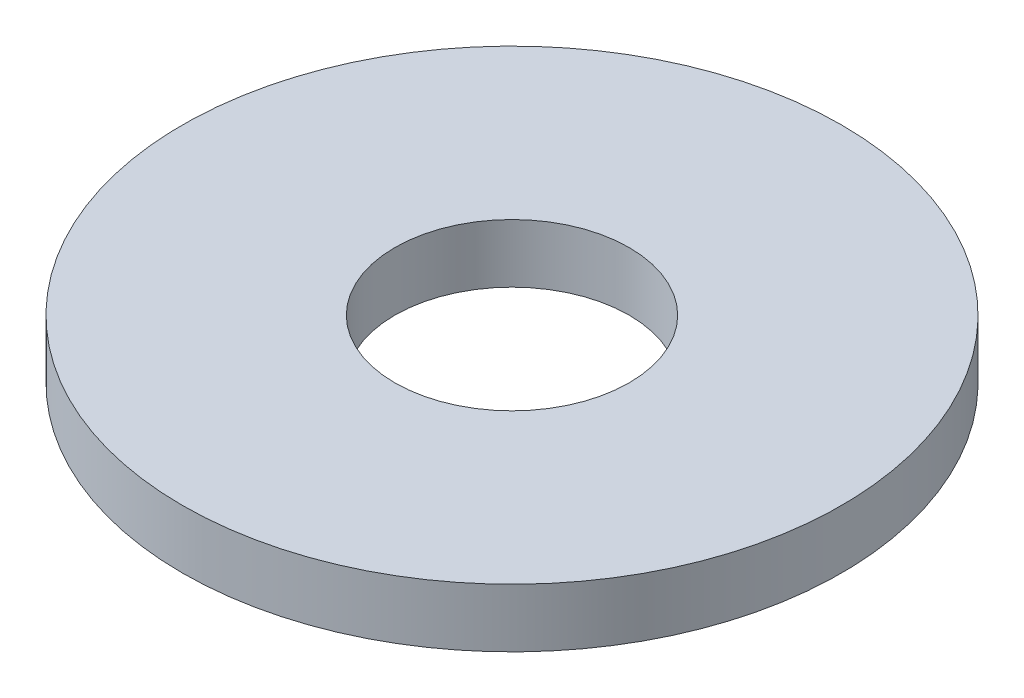
ISO-10303-21;
HEADER;
FILE_DESCRIPTION(('STEP AP214'),'2;1');
FILE_NAME('part.step','',(''),(''),'','','');
FILE_SCHEMA(('AUTOMOTIVE_DESIGN { 1 0 10303 214 1 1 1 1 }'));
ENDSEC;
DATA;
#1=APPLICATION_CONTEXT('core data for automotive mechanical design processes');
#2=APPLICATION_PROTOCOL_DEFINITION('international standard','automotive_design',2000,#1);
#3=PRODUCT_CONTEXT('',#1,'mechanical');
#4=PRODUCT('Part','Part','',(#3));
#5=PRODUCT_RELATED_PRODUCT_CATEGORY('part','',(#4));
#6=PRODUCT_DEFINITION_FORMATION('','',#4);
#7=PRODUCT_DEFINITION_CONTEXT('part definition',#1,'design');
#8=PRODUCT_DEFINITION('design','',#6,#7);
#9=PRODUCT_DEFINITION_SHAPE('','',#8);
#10=(LENGTH_UNIT() NAMED_UNIT(*) SI_UNIT(.MILLI.,.METRE.));
#11=(NAMED_UNIT(*) PLANE_ANGLE_UNIT() SI_UNIT($,.RADIAN.));
#12=(NAMED_UNIT(*) SI_UNIT($,.STERADIAN.) SOLID_ANGLE_UNIT());
#13=UNCERTAINTY_MEASURE_WITH_UNIT(LENGTH_MEASURE(1.E-05),#10,'distance_accuracy_value','');
#14=(GEOMETRIC_REPRESENTATION_CONTEXT(3) GLOBAL_UNCERTAINTY_ASSIGNED_CONTEXT((#13)) GLOBAL_UNIT_ASSIGNED_CONTEXT((#10,
#11,#12)) REPRESENTATION_CONTEXT('',''));
#15=CARTESIAN_POINT('',(0.,0.,0.));
#16=DIRECTION('',(0.,0.,1.));
#17=DIRECTION('',(1.,0.,0.));
#18=AXIS2_PLACEMENT_3D('',#15,#16,#17);
#19=CARTESIAN_POINT('',(0.,0.8,0.));
#20=DIRECTION('',(0.,1.,0.));
#21=DIRECTION('',(0.,0.,1.));
#22=AXIS2_PLACEMENT_3D('',#19,#20,#21);
#23=PLANE('',#22);
#24=CARTESIAN_POINT('',(0.,0.8,0.));
#25=DIRECTION('',(0.,1.,0.));
#26=DIRECTION('',(0.,0.,1.));
#27=AXIS2_PLACEMENT_3D('',#24,#25,#26);
#28=CIRCLE('',#27,4.5);
#29=CARTESIAN_POINT('',(0.,0.8,4.5));
#30=VERTEX_POINT('',#29);
#31=EDGE_CURVE('E10',#30,#30,#28,.T.);
#32=ORIENTED_EDGE('',*,*,#31,.T.);
#33=EDGE_LOOP('',(#32));
#34=FACE_BOUND('',#33,.T.);
#35=CARTESIAN_POINT('',(0.,0.8,0.));
#36=DIRECTION('',(0.,1.,0.));
#37=DIRECTION('',(0.,0.,1.));
#38=AXIS2_PLACEMENT_3D('',#35,#36,#37);
#39=CIRCLE('',#38,1.6);
#40=CARTESIAN_POINT('',(0.,0.8,1.6));
#41=VERTEX_POINT('',#40);
#42=EDGE_CURVE('E26',#41,#41,#39,.T.);
#43=ORIENTED_EDGE('',*,*,#42,.F.);
#44=EDGE_LOOP('',(#43));
#45=FACE_BOUND('',#44,.T.);
#46=ADVANCED_FACE('F14',(#34,#45),#23,.T.);
#47=CARTESIAN_POINT('',(0.,0.,0.));
#48=DIRECTION('',(0.,1.,0.));
#49=DIRECTION('',(0.,0.,1.));
#50=AXIS2_PLACEMENT_3D('',#47,#48,#49);
#51=PLANE('',#50);
#52=CARTESIAN_POINT('',(0.,0.,0.));
#53=DIRECTION('',(0.,1.,0.));
#54=DIRECTION('',(0.,0.,1.));
#55=AXIS2_PLACEMENT_3D('',#52,#53,#54);
#56=CIRCLE('',#55,4.5);
#57=CARTESIAN_POINT('',(0.,0.,4.5));
#58=VERTEX_POINT('',#57);
#59=EDGE_CURVE('E18',#58,#58,#56,.T.);
#60=ORIENTED_EDGE('',*,*,#59,.F.);
#61=EDGE_LOOP('',(#60));
#62=FACE_BOUND('',#61,.T.);
#63=CARTESIAN_POINT('',(0.,0.,0.));
#64=DIRECTION('',(0.,1.,0.));
#65=DIRECTION('',(0.,0.,1.));
#66=AXIS2_PLACEMENT_3D('',#63,#64,#65);
#67=CIRCLE('',#66,1.6);
#68=CARTESIAN_POINT('',(0.,0.,1.6));
#69=VERTEX_POINT('',#68);
#70=EDGE_CURVE('E28',#69,#69,#67,.T.);
#71=ORIENTED_EDGE('',*,*,#70,.T.);
#72=EDGE_LOOP('',(#71));
#73=FACE_BOUND('',#72,.T.);
#74=ADVANCED_FACE('F38',(#62,#73),#51,.F.);
#75=CARTESIAN_POINT('',(0.,0.8,0.));
#76=DIRECTION('',(0.,-1.,0.));
#77=DIRECTION('',(0.,0.,-1.));
#78=AXIS2_PLACEMENT_3D('',#75,#76,#77);
#79=CYLINDRICAL_SURFACE('',#78,4.5);
#80=ORIENTED_EDGE('',*,*,#31,.F.);
#81=EDGE_LOOP('',(#80));
#82=FACE_BOUND('',#81,.T.);
#83=ORIENTED_EDGE('',*,*,#59,.T.);
#84=EDGE_LOOP('',(#83));
#85=FACE_BOUND('',#84,.T.);
#86=ADVANCED_FACE('F16',(#82,#85),#79,.T.);
#87=CARTESIAN_POINT('',(0.,0.8,0.));
#88=DIRECTION('',(0.,-1.,0.));
#89=DIRECTION('',(0.,0.,-1.));
#90=AXIS2_PLACEMENT_3D('',#87,#88,#89);
#91=CYLINDRICAL_SURFACE('',#90,1.6);
#92=ORIENTED_EDGE('',*,*,#42,.T.);
#93=EDGE_LOOP('',(#92));
#94=FACE_BOUND('',#93,.T.);
#95=ORIENTED_EDGE('',*,*,#70,.F.);
#96=EDGE_LOOP('',(#95));
#97=FACE_BOUND('',#96,.T.);
#98=ADVANCED_FACE('F34',(#94,#97),#91,.F.);
#99=CLOSED_SHELL('',(#46,#74,#86,#98));
#100=MANIFOLD_SOLID_BREP('B1',#99);
#101=ADVANCED_BREP_SHAPE_REPRESENTATION('',(#18,#100),#14);
#102=SHAPE_DEFINITION_REPRESENTATION(#9,#101);
ENDSEC;
END-ISO-10303-21;
